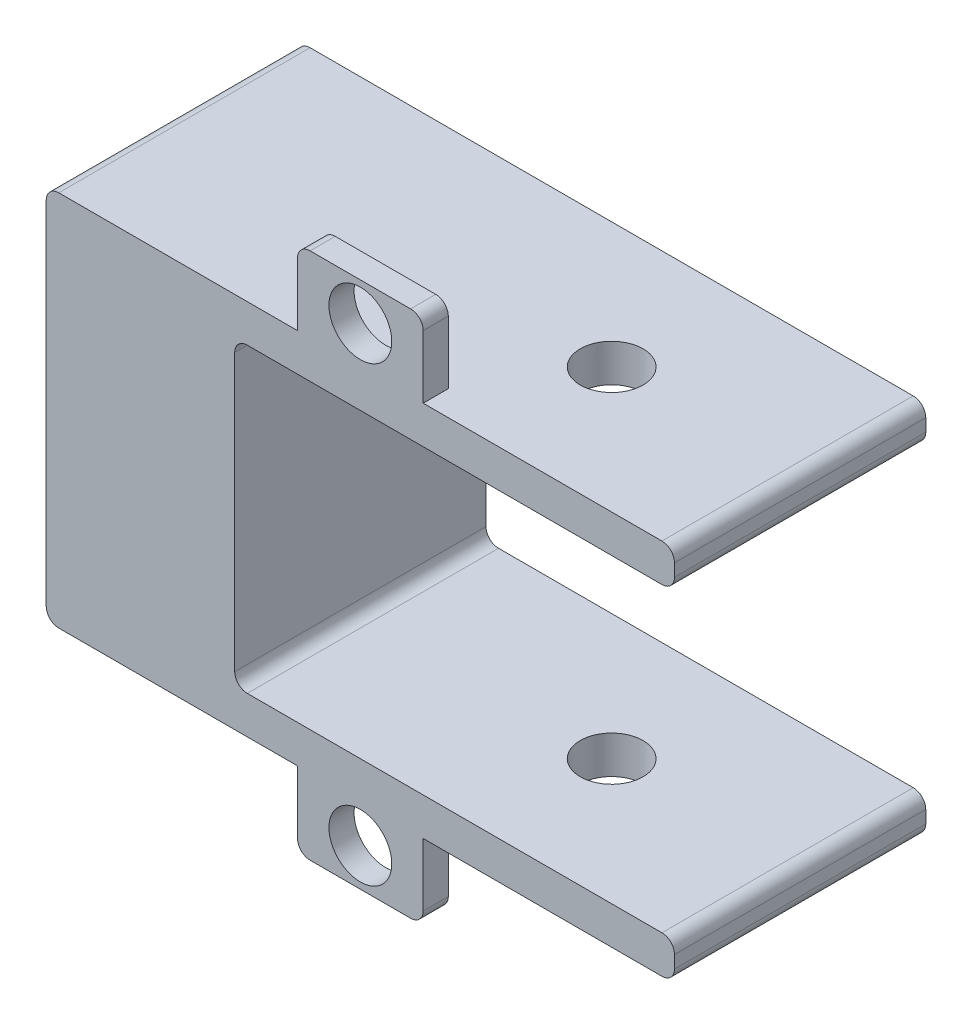
ISO-10303-21;
HEADER;
FILE_DESCRIPTION(('STEP AP214'),'2;1');
FILE_NAME('part.step','',(''),(''),'','','');
FILE_SCHEMA(('AUTOMOTIVE_DESIGN { 1 0 10303 214 1 1 1 1 }'));
ENDSEC;
DATA;
#1=APPLICATION_CONTEXT('core data for automotive mechanical design processes');
#2=APPLICATION_PROTOCOL_DEFINITION('international standard','automotive_design',2000,#1);
#3=PRODUCT_CONTEXT('',#1,'mechanical');
#4=PRODUCT('Part','Part','',(#3));
#5=PRODUCT_RELATED_PRODUCT_CATEGORY('part','',(#4));
#6=PRODUCT_DEFINITION_FORMATION('','',#4);
#7=PRODUCT_DEFINITION_CONTEXT('part definition',#1,'design');
#8=PRODUCT_DEFINITION('design','',#6,#7);
#9=PRODUCT_DEFINITION_SHAPE('','',#8);
#10=(LENGTH_UNIT() NAMED_UNIT(*) SI_UNIT(.MILLI.,.METRE.));
#11=(NAMED_UNIT(*) PLANE_ANGLE_UNIT() SI_UNIT($,.RADIAN.));
#12=(NAMED_UNIT(*) SI_UNIT($,.STERADIAN.) SOLID_ANGLE_UNIT());
#13=UNCERTAINTY_MEASURE_WITH_UNIT(LENGTH_MEASURE(1.E-05),#10,'distance_accuracy_value','');
#14=(GEOMETRIC_REPRESENTATION_CONTEXT(3) GLOBAL_UNCERTAINTY_ASSIGNED_CONTEXT((#13)) GLOBAL_UNIT_ASSIGNED_CONTEXT((#10,
#11,#12)) REPRESENTATION_CONTEXT('',''));
#15=CARTESIAN_POINT('',(0.,0.,0.));
#16=DIRECTION('',(0.,0.,1.));
#17=DIRECTION('',(1.,0.,0.));
#18=AXIS2_PLACEMENT_3D('',#15,#16,#17);
#19=CARTESIAN_POINT('',(0.,0.,25.4));
#20=DIRECTION('',(0.,1.,0.));
#21=DIRECTION('',(0.,0.,1.));
#22=AXIS2_PLACEMENT_3D('',#19,#20,#21);
#23=PLANE('',#22);
#24=CARTESIAN_POINT('',(44.45,0.,12.7));
#25=DIRECTION('',(0.,-1.,0.));
#26=DIRECTION('',(0.,0.,-1.));
#27=AXIS2_PLACEMENT_3D('',#24,#25,#26);
#28=CIRCLE('',#27,3.175);
#29=CARTESIAN_POINT('',(44.45,0.,9.525));
#30=VERTEX_POINT('',#29);
#31=EDGE_CURVE('E280',#30,#30,#28,.T.);
#32=ORIENTED_EDGE('',*,*,#31,.F.);
#33=EDGE_LOOP('',(#32));
#34=FACE_BOUND('',#33,.T.);
#35=DIRECTION('',(0.,0.,1.));
#36=VECTOR('',#35,1.);
#37=CARTESIAN_POINT('',(38.1,0.,22.86));
#38=LINE('',#37,#36);
#39=CARTESIAN_POINT('',(38.1,0.,22.86));
#40=VERTEX_POINT('',#39);
#41=CARTESIAN_POINT('',(38.1,0.,25.4));
#42=VERTEX_POINT('',#41);
#43=EDGE_CURVE('E240',#40,#42,#38,.T.);
#44=ORIENTED_EDGE('',*,*,#43,.F.);
#45=DIRECTION('',(-1.,0.,0.));
#46=VECTOR('',#45,1.);
#47=CARTESIAN_POINT('',(38.1,0.,22.86));
#48=LINE('',#47,#46);
#49=CARTESIAN_POINT('',(25.4,0.,22.86));
#50=VERTEX_POINT('',#49);
#51=EDGE_CURVE('E239',#40,#50,#48,.T.);
#52=ORIENTED_EDGE('',*,*,#51,.T.);
#53=DIRECTION('',(0.,0.,1.));
#54=VECTOR('',#53,1.);
#55=CARTESIAN_POINT('',(25.4,0.,22.86));
#56=LINE('',#55,#54);
#57=CARTESIAN_POINT('',(25.4,0.,25.4));
#58=VERTEX_POINT('',#57);
#59=EDGE_CURVE('E223',#50,#58,#56,.T.);
#60=ORIENTED_EDGE('',*,*,#59,.T.);
#61=DIRECTION('',(1.,0.,0.));
#62=VECTOR('',#61,1.);
#63=CARTESIAN_POINT('',(0.,0.,25.4));
#64=LINE('',#63,#62);
#65=CARTESIAN_POINT('',(1.27,0.,25.4));
#66=VERTEX_POINT('',#65);
#67=EDGE_CURVE('E236',#66,#58,#64,.T.);
#68=ORIENTED_EDGE('',*,*,#67,.F.);
#69=DIRECTION('',(0.,0.,-1.));
#70=VECTOR('',#69,1.);
#71=CARTESIAN_POINT('',(1.27,0.,25.4));
#72=LINE('',#71,#70);
#73=CARTESIAN_POINT('',(1.27,0.,0.));
#74=VERTEX_POINT('',#73);
#75=EDGE_CURVE('E317',#66,#74,#72,.T.);
#76=ORIENTED_EDGE('',*,*,#75,.T.);
#77=DIRECTION('',(1.,0.,0.));
#78=VECTOR('',#77,1.);
#79=CARTESIAN_POINT('',(0.,0.,0.));
#80=LINE('',#79,#78);
#81=CARTESIAN_POINT('',(62.23,0.,0.));
#82=VERTEX_POINT('',#81);
#83=EDGE_CURVE('E265',#74,#82,#80,.T.);
#84=ORIENTED_EDGE('',*,*,#83,.T.);
#85=DIRECTION('',(0.,0.,-1.));
#86=VECTOR('',#85,1.);
#87=CARTESIAN_POINT('',(62.23,0.,25.4));
#88=LINE('',#87,#86);
#89=CARTESIAN_POINT('',(62.23,0.,25.4));
#90=VERTEX_POINT('',#89);
#91=EDGE_CURVE('E314',#82,#90,#88,.F.);
#92=ORIENTED_EDGE('',*,*,#91,.T.);
#93=EDGE_CURVE('E247',#42,#90,#64,.T.);
#94=ORIENTED_EDGE('',*,*,#93,.F.);
#95=EDGE_LOOP('',(#44,#52,#60,#68,#76,#84,#92,#94));
#96=FACE_BOUND('',#95,.T.);
#97=ADVANCED_FACE('F33',(#34,#96),#23,.F.);
#98=CARTESIAN_POINT('',(0.,38.1,25.4));
#99=DIRECTION('',(0.,-1.,0.));
#100=DIRECTION('',(0.,0.,-1.));
#101=AXIS2_PLACEMENT_3D('',#98,#99,#100);
#102=PLANE('',#101);
#103=CARTESIAN_POINT('',(44.45,38.1,12.7));
#104=DIRECTION('',(0.,-1.,0.));
#105=DIRECTION('',(0.,0.,-1.));
#106=AXIS2_PLACEMENT_3D('',#103,#104,#105);
#107=CIRCLE('',#106,3.175);
#108=CARTESIAN_POINT('',(44.45,38.1,9.525));
#109=VERTEX_POINT('',#108);
#110=EDGE_CURVE('E411',#109,#109,#107,.T.);
#111=ORIENTED_EDGE('',*,*,#110,.T.);
#112=EDGE_LOOP('',(#111));
#113=FACE_BOUND('',#112,.T.);
#114=DIRECTION('',(0.,0.,1.));
#115=VECTOR('',#114,1.);
#116=CARTESIAN_POINT('',(25.4,38.1,25.4));
#117=LINE('',#116,#115);
#118=CARTESIAN_POINT('',(25.4,38.1,22.86));
#119=VERTEX_POINT('',#118);
#120=CARTESIAN_POINT('',(25.4,38.1,25.4));
#121=VERTEX_POINT('',#120);
#122=EDGE_CURVE('E399',#119,#121,#117,.T.);
#123=ORIENTED_EDGE('',*,*,#122,.F.);
#124=DIRECTION('',(-1.,0.,0.));
#125=VECTOR('',#124,1.);
#126=CARTESIAN_POINT('',(25.4,38.1,22.86));
#127=LINE('',#126,#125);
#128=CARTESIAN_POINT('',(38.1,38.1,22.86));
#129=VERTEX_POINT('',#128);
#130=EDGE_CURVE('E468',#129,#119,#127,.T.);
#131=ORIENTED_EDGE('',*,*,#130,.F.);
#132=DIRECTION('',(0.,0.,-1.));
#133=VECTOR('',#132,1.);
#134=CARTESIAN_POINT('',(38.1,38.1,25.4));
#135=LINE('',#134,#133);
#136=CARTESIAN_POINT('',(38.1,38.1,25.4));
#137=VERTEX_POINT('',#136);
#138=EDGE_CURVE('E459',#137,#129,#135,.T.);
#139=ORIENTED_EDGE('',*,*,#138,.F.);
#140=DIRECTION('',(-1.,0.,0.));
#141=VECTOR('',#140,1.);
#142=CARTESIAN_POINT('',(0.,38.1,25.4));
#143=LINE('',#142,#141);
#144=CARTESIAN_POINT('',(62.23,38.1,25.4));
#145=VERTEX_POINT('',#144);
#146=EDGE_CURVE('E258',#145,#137,#143,.T.);
#147=ORIENTED_EDGE('',*,*,#146,.F.);
#148=DIRECTION('',(0.,0.,-1.));
#149=VECTOR('',#148,1.);
#150=CARTESIAN_POINT('',(62.23,38.1,25.4));
#151=LINE('',#150,#149);
#152=CARTESIAN_POINT('',(62.23,38.1,0.));
#153=VERTEX_POINT('',#152);
#154=EDGE_CURVE('E297',#145,#153,#151,.T.);
#155=ORIENTED_EDGE('',*,*,#154,.T.);
#156=DIRECTION('',(-1.,0.,0.));
#157=VECTOR('',#156,1.);
#158=CARTESIAN_POINT('',(0.,38.1,0.));
#159=LINE('',#158,#157);
#160=CARTESIAN_POINT('',(1.27,38.1,0.));
#161=VERTEX_POINT('',#160);
#162=EDGE_CURVE('E273',#153,#161,#159,.T.);
#163=ORIENTED_EDGE('',*,*,#162,.T.);
#164=DIRECTION('',(0.,0.,-1.));
#165=VECTOR('',#164,1.);
#166=CARTESIAN_POINT('',(1.27,38.1,25.4));
#167=LINE('',#166,#165);
#168=CARTESIAN_POINT('',(1.27,38.1,25.4));
#169=VERTEX_POINT('',#168);
#170=EDGE_CURVE('E300',#161,#169,#167,.F.);
#171=ORIENTED_EDGE('',*,*,#170,.T.);
#172=EDGE_CURVE('E257',#121,#169,#143,.T.);
#173=ORIENTED_EDGE('',*,*,#172,.F.);
#174=EDGE_LOOP('',(#123,#131,#139,#147,#155,#163,#171,#173));
#175=FACE_BOUND('',#174,.T.);
#176=ADVANCED_FACE('F454',(#113,#175),#102,.F.);
#177=CARTESIAN_POINT('',(63.5,0.,25.4));
#178=DIRECTION('',(-1.,0.,0.));
#179=DIRECTION('',(0.,0.,1.));
#180=AXIS2_PLACEMENT_3D('',#177,#178,#179);
#181=PLANE('',#180);
#182=DIRECTION('',(0.,1.,0.));
#183=VECTOR('',#182,1.);
#184=CARTESIAN_POINT('',(63.5,0.,0.));
#185=LINE('',#184,#183);
#186=CARTESIAN_POINT('',(63.5,35.56,0.));
#187=VERTEX_POINT('',#186);
#188=CARTESIAN_POINT('',(63.5,36.83,0.));
#189=VERTEX_POINT('',#188);
#190=EDGE_CURVE('E269',#187,#189,#185,.T.);
#191=ORIENTED_EDGE('',*,*,#190,.T.);
#192=DIRECTION('',(0.,0.,-1.));
#193=VECTOR('',#192,1.);
#194=CARTESIAN_POINT('',(63.5,36.83,25.4));
#195=LINE('',#194,#193);
#196=CARTESIAN_POINT('',(63.5,36.83,25.4));
#197=VERTEX_POINT('',#196);
#198=EDGE_CURVE('E342',#189,#197,#195,.F.);
#199=ORIENTED_EDGE('',*,*,#198,.T.);
#200=DIRECTION('',(0.,1.,0.));
#201=VECTOR('',#200,1.);
#202=CARTESIAN_POINT('',(63.5,0.,25.4));
#203=LINE('',#202,#201);
#204=CARTESIAN_POINT('',(63.5,35.56,25.4));
#205=VERTEX_POINT('',#204);
#206=EDGE_CURVE('E246',#205,#197,#203,.T.);
#207=ORIENTED_EDGE('',*,*,#206,.F.);
#208=DIRECTION('',(0.,0.,-1.));
#209=VECTOR('',#208,1.);
#210=CARTESIAN_POINT('',(63.5,35.56,25.4));
#211=LINE('',#210,#209);
#212=EDGE_CURVE('E339',#205,#187,#211,.T.);
#213=ORIENTED_EDGE('',*,*,#212,.T.);
#214=EDGE_LOOP('',(#191,#199,#207,#213));
#215=FACE_BOUND('',#214,.T.);
#216=ADVANCED_FACE('F441',(#215),#181,.F.);
#217=CARTESIAN_POINT('',(0.,0.,25.4));
#218=DIRECTION('',(1.,0.,0.));
#219=DIRECTION('',(0.,0.,-1.));
#220=AXIS2_PLACEMENT_3D('',#217,#218,#219);
#221=PLANE('',#220);
#222=DIRECTION('',(0.,-1.,0.));
#223=VECTOR('',#222,1.);
#224=CARTESIAN_POINT('',(0.,0.,25.4));
#225=LINE('',#224,#223);
#226=CARTESIAN_POINT('',(0.,36.83,25.4));
#227=VERTEX_POINT('',#226);
#228=CARTESIAN_POINT('',(0.,1.27,25.4));
#229=VERTEX_POINT('',#228);
#230=EDGE_CURVE('E252',#227,#229,#225,.T.);
#231=ORIENTED_EDGE('',*,*,#230,.F.);
#232=DIRECTION('',(0.,0.,-1.));
#233=VECTOR('',#232,1.);
#234=CARTESIAN_POINT('',(0.,36.83,25.4));
#235=LINE('',#234,#233);
#236=CARTESIAN_POINT('',(0.,36.83,0.));
#237=VERTEX_POINT('',#236);
#238=EDGE_CURVE('E282',#227,#237,#235,.T.);
#239=ORIENTED_EDGE('',*,*,#238,.T.);
#240=DIRECTION('',(0.,-1.,0.));
#241=VECTOR('',#240,1.);
#242=CARTESIAN_POINT('',(0.,0.,0.));
#243=LINE('',#242,#241);
#244=CARTESIAN_POINT('',(0.,1.27,0.));
#245=VERTEX_POINT('',#244);
#246=EDGE_CURVE('E262',#237,#245,#243,.T.);
#247=ORIENTED_EDGE('',*,*,#246,.T.);
#248=DIRECTION('',(0.,0.,-1.));
#249=VECTOR('',#248,1.);
#250=CARTESIAN_POINT('',(0.,1.27,25.4));
#251=LINE('',#250,#249);
#252=EDGE_CURVE('E261',#245,#229,#251,.F.);
#253=ORIENTED_EDGE('',*,*,#252,.T.);
#254=EDGE_LOOP('',(#231,#239,#247,#253));
#255=FACE_BOUND('',#254,.T.);
#256=ADVANCED_FACE('F523',(#255),#221,.F.);
#257=CARTESIAN_POINT('',(63.5,1.27,0.));
#258=VERTEX_POINT('',#257);
#259=CARTESIAN_POINT('',(63.5,2.54,0.));
#260=VERTEX_POINT('',#259);
#261=EDGE_CURVE('E272',#258,#260,#185,.T.);
#262=ORIENTED_EDGE('',*,*,#261,.T.);
#263=DIRECTION('',(0.,0.,-1.));
#264=VECTOR('',#263,1.);
#265=CARTESIAN_POINT('',(63.5,2.54,25.4));
#266=LINE('',#265,#264);
#267=CARTESIAN_POINT('',(63.5,2.54,25.4));
#268=VERTEX_POINT('',#267);
#269=EDGE_CURVE('E337',#260,#268,#266,.F.);
#270=ORIENTED_EDGE('',*,*,#269,.T.);
#271=CARTESIAN_POINT('',(63.5,1.27,25.4));
#272=VERTEX_POINT('',#271);
#273=EDGE_CURVE('E250',#272,#268,#203,.T.);
#274=ORIENTED_EDGE('',*,*,#273,.F.);
#275=DIRECTION('',(0.,0.,-1.));
#276=VECTOR('',#275,1.);
#277=CARTESIAN_POINT('',(63.5,1.27,25.4));
#278=LINE('',#277,#276);
#279=EDGE_CURVE('E334',#272,#258,#278,.T.);
#280=ORIENTED_EDGE('',*,*,#279,.T.);
#281=EDGE_LOOP('',(#262,#270,#274,#280));
#282=FACE_BOUND('',#281,.T.);
#283=ADVANCED_FACE('F522',(#282),#181,.F.);
#284=CARTESIAN_POINT('',(0.,0.,25.4));
#285=DIRECTION('',(0.,0.,-1.));
#286=DIRECTION('',(-1.,0.,0.));
#287=AXIS2_PLACEMENT_3D('',#284,#285,#286);
#288=PLANE('',#287);
#289=CARTESIAN_POINT('',(31.75,41.91,25.4));
#290=DIRECTION('',(0.,0.,-1.));
#291=DIRECTION('',(-1.,0.,0.));
#292=AXIS2_PLACEMENT_3D('',#289,#290,#291);
#293=CIRCLE('',#292,3.175);
#294=CARTESIAN_POINT('',(28.575,41.91,25.4));
#295=VERTEX_POINT('',#294);
#296=EDGE_CURVE('E492',#295,#295,#293,.F.);
#297=ORIENTED_EDGE('',*,*,#296,.F.);
#298=EDGE_LOOP('',(#297));
#299=FACE_BOUND('',#298,.T.);
#300=CARTESIAN_POINT('',(31.75,-3.81,25.4));
#301=DIRECTION('',(0.,0.,-1.));
#302=DIRECTION('',(-1.,0.,0.));
#303=AXIS2_PLACEMENT_3D('',#300,#301,#302);
#304=CIRCLE('',#303,3.175);
#305=CARTESIAN_POINT('',(28.575,-3.81,25.4));
#306=VERTEX_POINT('',#305);
#307=EDGE_CURVE('E482',#306,#306,#304,.F.);
#308=ORIENTED_EDGE('',*,*,#307,.F.);
#309=EDGE_LOOP('',(#308));
#310=FACE_BOUND('',#309,.T.);
#311=DIRECTION('',(0.,1.,0.));
#312=VECTOR('',#311,1.);
#313=CARTESIAN_POINT('',(25.4,-7.62,25.4));
#314=LINE('',#313,#312);
#315=CARTESIAN_POINT('',(25.4,-6.35,25.4));
#316=VERTEX_POINT('',#315);
#317=EDGE_CURVE('E219',#316,#58,#314,.T.);
#318=ORIENTED_EDGE('',*,*,#317,.F.);
#319=CARTESIAN_POINT('',(26.67,-6.35,25.4));
#320=DIRECTION('',(0.,0.,-1.));
#321=DIRECTION('',(-1.,0.,0.));
#322=AXIS2_PLACEMENT_3D('',#319,#320,#321);
#323=CIRCLE('',#322,1.27);
#324=CARTESIAN_POINT('',(26.67,-7.62,25.4));
#325=VERTEX_POINT('',#324);
#326=EDGE_CURVE('E359',#316,#325,#323,.F.);
#327=ORIENTED_EDGE('',*,*,#326,.T.);
#328=DIRECTION('',(-1.,0.,0.));
#329=VECTOR('',#328,1.);
#330=CARTESIAN_POINT('',(38.1,-7.62,25.4));
#331=LINE('',#330,#329);
#332=CARTESIAN_POINT('',(36.83,-7.62,25.4));
#333=VERTEX_POINT('',#332);
#334=EDGE_CURVE('E478',#333,#325,#331,.T.);
#335=ORIENTED_EDGE('',*,*,#334,.F.);
#336=CARTESIAN_POINT('',(36.83,-6.35,25.4));
#337=DIRECTION('',(0.,0.,-1.));
#338=DIRECTION('',(-1.,0.,0.));
#339=AXIS2_PLACEMENT_3D('',#336,#337,#338);
#340=CIRCLE('',#339,1.27);
#341=CARTESIAN_POINT('',(38.1,-6.35,25.4));
#342=VERTEX_POINT('',#341);
#343=EDGE_CURVE('E357',#333,#342,#340,.F.);
#344=ORIENTED_EDGE('',*,*,#343,.T.);
#345=DIRECTION('',(0.,1.,0.));
#346=VECTOR('',#345,1.);
#347=CARTESIAN_POINT('',(38.1,-7.62,25.4));
#348=LINE('',#347,#346);
#349=EDGE_CURVE('E229',#342,#42,#348,.T.);
#350=ORIENTED_EDGE('',*,*,#349,.T.);
#351=ORIENTED_EDGE('',*,*,#93,.T.);
#352=CARTESIAN_POINT('',(62.23,1.27,25.4));
#353=DIRECTION('',(0.,0.,-1.));
#354=DIRECTION('',(-1.,0.,0.));
#355=AXIS2_PLACEMENT_3D('',#352,#353,#354);
#356=CIRCLE('',#355,1.27);
#357=EDGE_CURVE('E303',#90,#272,#356,.F.);
#358=ORIENTED_EDGE('',*,*,#357,.T.);
#359=ORIENTED_EDGE('',*,*,#273,.T.);
#360=CARTESIAN_POINT('',(62.23,2.54,25.4));
#361=DIRECTION('',(0.,0.,-1.));
#362=DIRECTION('',(-1.,0.,0.));
#363=AXIS2_PLACEMENT_3D('',#360,#361,#362);
#364=CIRCLE('',#363,1.27);
#365=CARTESIAN_POINT('',(62.23,3.81,25.4));
#366=VERTEX_POINT('',#365);
#367=EDGE_CURVE('E309',#268,#366,#364,.F.);
#368=ORIENTED_EDGE('',*,*,#367,.T.);
#369=DIRECTION('',(-1.,0.,0.));
#370=VECTOR('',#369,1.);
#371=CARTESIAN_POINT('',(0.,3.81,25.4));
#372=LINE('',#371,#370);
#373=CARTESIAN_POINT('',(20.32,3.81,25.4));
#374=VERTEX_POINT('',#373);
#375=EDGE_CURVE('E423',#366,#374,#372,.T.);
#376=ORIENTED_EDGE('',*,*,#375,.T.);
#377=CARTESIAN_POINT('',(20.32,5.08,25.4));
#378=DIRECTION('',(0.,0.,-1.));
#379=DIRECTION('',(-1.,0.,0.));
#380=AXIS2_PLACEMENT_3D('',#377,#378,#379);
#381=CIRCLE('',#380,1.27);
#382=CARTESIAN_POINT('',(19.05,5.08,25.4));
#383=VERTEX_POINT('',#382);
#384=EDGE_CURVE('E346',#374,#383,#381,.T.);
#385=ORIENTED_EDGE('',*,*,#384,.T.);
#386=DIRECTION('',(0.,1.,0.));
#387=VECTOR('',#386,1.);
#388=CARTESIAN_POINT('',(19.05,0.,25.4));
#389=LINE('',#388,#387);
#390=CARTESIAN_POINT('',(19.05,33.02,25.4));
#391=VERTEX_POINT('',#390);
#392=EDGE_CURVE('E426',#383,#391,#389,.T.);
#393=ORIENTED_EDGE('',*,*,#392,.T.);
#394=CARTESIAN_POINT('',(20.32,33.02,25.4));
#395=DIRECTION('',(0.,0.,-1.));
#396=DIRECTION('',(-1.,0.,0.));
#397=AXIS2_PLACEMENT_3D('',#394,#395,#396);
#398=CIRCLE('',#397,1.27);
#399=CARTESIAN_POINT('',(20.32,34.29,25.4));
#400=VERTEX_POINT('',#399);
#401=EDGE_CURVE('E350',#391,#400,#398,.T.);
#402=ORIENTED_EDGE('',*,*,#401,.T.);
#403=DIRECTION('',(1.,0.,0.));
#404=VECTOR('',#403,1.);
#405=CARTESIAN_POINT('',(0.,34.29,25.4));
#406=LINE('',#405,#404);
#407=CARTESIAN_POINT('',(62.23,34.29,25.4));
#408=VERTEX_POINT('',#407);
#409=EDGE_CURVE('E266',#400,#408,#406,.T.);
#410=ORIENTED_EDGE('',*,*,#409,.T.);
#411=CARTESIAN_POINT('',(62.23,35.56,25.4));
#412=DIRECTION('',(0.,0.,-1.));
#413=DIRECTION('',(-1.,0.,0.));
#414=AXIS2_PLACEMENT_3D('',#411,#412,#413);
#415=CIRCLE('',#414,1.27);
#416=EDGE_CURVE('E305',#408,#205,#415,.F.);
#417=ORIENTED_EDGE('',*,*,#416,.T.);
#418=ORIENTED_EDGE('',*,*,#206,.T.);
#419=CARTESIAN_POINT('',(62.23,36.83,25.4));
#420=DIRECTION('',(0.,0.,-1.));
#421=DIRECTION('',(-1.,0.,0.));
#422=AXIS2_PLACEMENT_3D('',#419,#420,#421);
#423=CIRCLE('',#422,1.27);
#424=EDGE_CURVE('E307',#197,#145,#423,.F.);
#425=ORIENTED_EDGE('',*,*,#424,.T.);
#426=ORIENTED_EDGE('',*,*,#146,.T.);
#427=DIRECTION('',(0.,-1.,0.));
#428=VECTOR('',#427,1.);
#429=CARTESIAN_POINT('',(38.1,45.72,25.4));
#430=LINE('',#429,#428);
#431=CARTESIAN_POINT('',(38.1,44.45,25.4));
#432=VERTEX_POINT('',#431);
#433=EDGE_CURVE('E401',#432,#137,#430,.T.);
#434=ORIENTED_EDGE('',*,*,#433,.F.);
#435=CARTESIAN_POINT('',(36.83,44.45,25.4));
#436=DIRECTION('',(0.,0.,-1.));
#437=DIRECTION('',(-1.,0.,0.));
#438=AXIS2_PLACEMENT_3D('',#435,#436,#437);
#439=CIRCLE('',#438,1.27);
#440=CARTESIAN_POINT('',(36.83,45.72,25.4));
#441=VERTEX_POINT('',#440);
#442=EDGE_CURVE('E353',#432,#441,#439,.F.);
#443=ORIENTED_EDGE('',*,*,#442,.T.);
#444=DIRECTION('',(1.,0.,0.));
#445=VECTOR('',#444,1.);
#446=CARTESIAN_POINT('',(25.4,45.72,25.4));
#447=LINE('',#446,#445);
#448=CARTESIAN_POINT('',(26.67,45.72,25.4));
#449=VERTEX_POINT('',#448);
#450=EDGE_CURVE('E392',#449,#441,#447,.T.);
#451=ORIENTED_EDGE('',*,*,#450,.F.);
#452=CARTESIAN_POINT('',(26.67,44.45,25.4));
#453=DIRECTION('',(0.,0.,-1.));
#454=DIRECTION('',(-1.,0.,0.));
#455=AXIS2_PLACEMENT_3D('',#452,#453,#454);
#456=CIRCLE('',#455,1.27);
#457=CARTESIAN_POINT('',(25.4,44.45,25.4));
#458=VERTEX_POINT('',#457);
#459=EDGE_CURVE('E355',#449,#458,#456,.F.);
#460=ORIENTED_EDGE('',*,*,#459,.T.);
#461=DIRECTION('',(0.,-1.,0.));
#462=VECTOR('',#461,1.);
#463=CARTESIAN_POINT('',(25.4,45.72,25.4));
#464=LINE('',#463,#462);
#465=EDGE_CURVE('E395',#458,#121,#464,.T.);
#466=ORIENTED_EDGE('',*,*,#465,.T.);
#467=ORIENTED_EDGE('',*,*,#172,.T.);
#468=CARTESIAN_POINT('',(1.27,36.83,25.4));
#469=DIRECTION('',(0.,0.,-1.));
#470=DIRECTION('',(-1.,0.,0.));
#471=AXIS2_PLACEMENT_3D('',#468,#469,#470);
#472=CIRCLE('',#471,1.27);
#473=EDGE_CURVE('E312',#169,#227,#472,.F.);
#474=ORIENTED_EDGE('',*,*,#473,.T.);
#475=ORIENTED_EDGE('',*,*,#230,.T.);
#476=CARTESIAN_POINT('',(1.27,1.27,25.4));
#477=DIRECTION('',(0.,0.,-1.));
#478=DIRECTION('',(-1.,0.,0.));
#479=AXIS2_PLACEMENT_3D('',#476,#477,#478);
#480=CIRCLE('',#479,1.27);
#481=EDGE_CURVE('E245',#229,#66,#480,.F.);
#482=ORIENTED_EDGE('',*,*,#481,.T.);
#483=ORIENTED_EDGE('',*,*,#67,.T.);
#484=EDGE_LOOP('',(#318,#327,#335,#344,#350,#351,#358,#359,#368,#376,#385,#393,#402,#410,#417,
#418,#425,#426,#434,#443,#451,#460,#466,#467,#474,#475,#482,#483));
#485=FACE_BOUND('',#484,.T.);
#486=ADVANCED_FACE('F242',(#299,#310,#485),#288,.F.);
#487=CARTESIAN_POINT('',(0.,0.,0.));
#488=DIRECTION('',(0.,0.,-1.));
#489=DIRECTION('',(-1.,0.,0.));
#490=AXIS2_PLACEMENT_3D('',#487,#488,#489);
#491=PLANE('',#490);
#492=ORIENTED_EDGE('',*,*,#246,.F.);
#493=CARTESIAN_POINT('',(1.27,36.83,0.));
#494=DIRECTION('',(0.,0.,-1.));
#495=DIRECTION('',(-1.,0.,0.));
#496=AXIS2_PLACEMENT_3D('',#493,#494,#495);
#497=CIRCLE('',#496,1.27);
#498=EDGE_CURVE('E295',#237,#161,#497,.T.);
#499=ORIENTED_EDGE('',*,*,#498,.T.);
#500=ORIENTED_EDGE('',*,*,#162,.F.);
#501=CARTESIAN_POINT('',(62.23,36.83,0.));
#502=DIRECTION('',(0.,0.,-1.));
#503=DIRECTION('',(-1.,0.,0.));
#504=AXIS2_PLACEMENT_3D('',#501,#502,#503);
#505=CIRCLE('',#504,1.27);
#506=EDGE_CURVE('E289',#153,#189,#505,.T.);
#507=ORIENTED_EDGE('',*,*,#506,.T.);
#508=ORIENTED_EDGE('',*,*,#190,.F.);
#509=CARTESIAN_POINT('',(62.23,35.56,0.));
#510=DIRECTION('',(0.,0.,-1.));
#511=DIRECTION('',(-1.,0.,0.));
#512=AXIS2_PLACEMENT_3D('',#509,#510,#511);
#513=CIRCLE('',#512,1.27);
#514=CARTESIAN_POINT('',(62.23,34.29,0.));
#515=VERTEX_POINT('',#514);
#516=EDGE_CURVE('E287',#187,#515,#513,.T.);
#517=ORIENTED_EDGE('',*,*,#516,.T.);
#518=DIRECTION('',(1.,0.,0.));
#519=VECTOR('',#518,1.);
#520=CARTESIAN_POINT('',(63.5,34.29,0.));
#521=LINE('',#520,#519);
#522=CARTESIAN_POINT('',(20.32,34.29,0.));
#523=VERTEX_POINT('',#522);
#524=EDGE_CURVE('E420',#523,#515,#521,.T.);
#525=ORIENTED_EDGE('',*,*,#524,.F.);
#526=CARTESIAN_POINT('',(20.32,33.02,0.));
#527=DIRECTION('',(0.,0.,-1.));
#528=DIRECTION('',(-1.,0.,0.));
#529=AXIS2_PLACEMENT_3D('',#526,#527,#528);
#530=CIRCLE('',#529,1.27);
#531=CARTESIAN_POINT('',(19.05,33.02,0.));
#532=VERTEX_POINT('',#531);
#533=EDGE_CURVE('E348',#523,#532,#530,.F.);
#534=ORIENTED_EDGE('',*,*,#533,.T.);
#535=DIRECTION('',(0.,1.,0.));
#536=VECTOR('',#535,1.);
#537=CARTESIAN_POINT('',(19.05,34.29,0.));
#538=LINE('',#537,#536);
#539=CARTESIAN_POINT('',(19.05,5.08,0.));
#540=VERTEX_POINT('',#539);
#541=EDGE_CURVE('E417',#540,#532,#538,.T.);
#542=ORIENTED_EDGE('',*,*,#541,.F.);
#543=CARTESIAN_POINT('',(20.32,5.08,0.));
#544=DIRECTION('',(0.,0.,-1.));
#545=DIRECTION('',(-1.,0.,0.));
#546=AXIS2_PLACEMENT_3D('',#543,#544,#545);
#547=CIRCLE('',#546,1.27);
#548=CARTESIAN_POINT('',(20.32,3.81,0.));
#549=VERTEX_POINT('',#548);
#550=EDGE_CURVE('E344',#540,#549,#547,.F.);
#551=ORIENTED_EDGE('',*,*,#550,.T.);
#552=DIRECTION('',(-1.,0.,0.));
#553=VECTOR('',#552,1.);
#554=CARTESIAN_POINT('',(63.5,3.81,0.));
#555=LINE('',#554,#553);
#556=CARTESIAN_POINT('',(62.23,3.81,0.));
#557=VERTEX_POINT('',#556);
#558=EDGE_CURVE('E414',#557,#549,#555,.T.);
#559=ORIENTED_EDGE('',*,*,#558,.F.);
#560=CARTESIAN_POINT('',(62.23,2.54,0.));
#561=DIRECTION('',(0.,0.,-1.));
#562=DIRECTION('',(-1.,0.,0.));
#563=AXIS2_PLACEMENT_3D('',#560,#561,#562);
#564=CIRCLE('',#563,1.27);
#565=EDGE_CURVE('E291',#557,#260,#564,.T.);
#566=ORIENTED_EDGE('',*,*,#565,.T.);
#567=ORIENTED_EDGE('',*,*,#261,.F.);
#568=CARTESIAN_POINT('',(62.23,1.27,0.));
#569=DIRECTION('',(0.,0.,-1.));
#570=DIRECTION('',(-1.,0.,0.));
#571=AXIS2_PLACEMENT_3D('',#568,#569,#570);
#572=CIRCLE('',#571,1.27);
#573=EDGE_CURVE('E285',#258,#82,#572,.T.);
#574=ORIENTED_EDGE('',*,*,#573,.T.);
#575=ORIENTED_EDGE('',*,*,#83,.F.);
#576=CARTESIAN_POINT('',(1.27,1.27,0.));
#577=DIRECTION('',(0.,0.,-1.));
#578=DIRECTION('',(-1.,0.,0.));
#579=AXIS2_PLACEMENT_3D('',#576,#577,#578);
#580=CIRCLE('',#579,1.27);
#581=EDGE_CURVE('E293',#74,#245,#580,.T.);
#582=ORIENTED_EDGE('',*,*,#581,.T.);
#583=EDGE_LOOP('',(#492,#499,#500,#507,#508,#517,#525,#534,#542,#551,#559,#566,#567,#574,#575,#582));
#584=FACE_BOUND('',#583,.T.);
#585=ADVANCED_FACE('F445',(#584),#491,.T.);
#586=CARTESIAN_POINT('',(63.5,34.29,38.1));
#587=DIRECTION('',(0.,1.,0.));
#588=DIRECTION('',(0.,0.,1.));
#589=AXIS2_PLACEMENT_3D('',#586,#587,#588);
#590=PLANE('',#589);
#591=CARTESIAN_POINT('',(44.45,34.29,12.7));
#592=DIRECTION('',(0.,1.,0.));
#593=DIRECTION('',(0.,0.,1.));
#594=AXIS2_PLACEMENT_3D('',#591,#592,#593);
#595=CIRCLE('',#594,3.175);
#596=CARTESIAN_POINT('',(44.45,34.29,15.875));
#597=VERTEX_POINT('',#596);
#598=EDGE_CURVE('E279',#597,#597,#595,.T.);
#599=ORIENTED_EDGE('',*,*,#598,.T.);
#600=EDGE_LOOP('',(#599));
#601=FACE_BOUND('',#600,.T.);
#602=ORIENTED_EDGE('',*,*,#409,.F.);
#603=DIRECTION('',(0.,0.,-1.));
#604=VECTOR('',#603,1.);
#605=CARTESIAN_POINT('',(20.32,34.29,0.));
#606=LINE('',#605,#604);
#607=EDGE_CURVE('E331',#400,#523,#606,.T.);
#608=ORIENTED_EDGE('',*,*,#607,.T.);
#609=ORIENTED_EDGE('',*,*,#524,.T.);
#610=DIRECTION('',(0.,0.,-1.));
#611=VECTOR('',#610,1.);
#612=CARTESIAN_POINT('',(62.23,34.29,38.1));
#613=LINE('',#612,#611);
#614=EDGE_CURVE('E329',#515,#408,#613,.F.);
#615=ORIENTED_EDGE('',*,*,#614,.T.);
#616=EDGE_LOOP('',(#602,#608,#609,#615));
#617=FACE_BOUND('',#616,.T.);
#618=ADVANCED_FACE('F760',(#601,#617),#590,.F.);
#619=CARTESIAN_POINT('',(19.05,34.29,38.1));
#620=DIRECTION('',(-1.,0.,0.));
#621=DIRECTION('',(0.,-1.,0.));
#622=AXIS2_PLACEMENT_3D('',#619,#620,#621);
#623=PLANE('',#622);
#624=ORIENTED_EDGE('',*,*,#392,.F.);
#625=DIRECTION('',(0.,0.,-1.));
#626=VECTOR('',#625,1.);
#627=CARTESIAN_POINT('',(19.05,5.08,0.));
#628=LINE('',#627,#626);
#629=EDGE_CURVE('E321',#383,#540,#628,.T.);
#630=ORIENTED_EDGE('',*,*,#629,.T.);
#631=ORIENTED_EDGE('',*,*,#541,.T.);
#632=DIRECTION('',(0.,0.,-1.));
#633=VECTOR('',#632,1.);
#634=CARTESIAN_POINT('',(19.05,33.02,25.4));
#635=LINE('',#634,#633);
#636=EDGE_CURVE('E319',#532,#391,#635,.F.);
#637=ORIENTED_EDGE('',*,*,#636,.T.);
#638=EDGE_LOOP('',(#624,#630,#631,#637));
#639=FACE_BOUND('',#638,.T.);
#640=ADVANCED_FACE('F748',(#639),#623,.F.);
#641=CARTESIAN_POINT('',(63.5,3.81,38.1));
#642=DIRECTION('',(0.,-1.,0.));
#643=DIRECTION('',(1.,0.,0.));
#644=AXIS2_PLACEMENT_3D('',#641,#642,#643);
#645=PLANE('',#644);
#646=CARTESIAN_POINT('',(44.45,3.81000000000001,12.7));
#647=DIRECTION('',(0.,-1.,0.));
#648=DIRECTION('',(1.,0.,0.));
#649=AXIS2_PLACEMENT_3D('',#646,#647,#648);
#650=CIRCLE('',#649,3.175);
#651=CARTESIAN_POINT('',(47.625,3.81000000000001,12.7));
#652=VERTEX_POINT('',#651);
#653=EDGE_CURVE('E276',#652,#652,#650,.T.);
#654=ORIENTED_EDGE('',*,*,#653,.T.);
#655=EDGE_LOOP('',(#654));
#656=FACE_BOUND('',#655,.T.);
#657=ORIENTED_EDGE('',*,*,#558,.T.);
#658=DIRECTION('',(0.,0.,-1.));
#659=VECTOR('',#658,1.);
#660=CARTESIAN_POINT('',(20.32,3.81,25.4));
#661=LINE('',#660,#659);
#662=EDGE_CURVE('E327',#549,#374,#661,.F.);
#663=ORIENTED_EDGE('',*,*,#662,.T.);
#664=ORIENTED_EDGE('',*,*,#375,.F.);
#665=DIRECTION('',(0.,0.,-1.));
#666=VECTOR('',#665,1.);
#667=CARTESIAN_POINT('',(62.23,3.81,38.1));
#668=LINE('',#667,#666);
#669=EDGE_CURVE('E324',#366,#557,#668,.T.);
#670=ORIENTED_EDGE('',*,*,#669,.T.);
#671=EDGE_LOOP('',(#657,#663,#664,#670));
#672=FACE_BOUND('',#671,.T.);
#673=ADVANCED_FACE('F742',(#656,#672),#645,.F.);
#674=CARTESIAN_POINT('',(44.45,76.2,12.7));
#675=DIRECTION('',(0.,-1.,0.));
#676=DIRECTION('',(0.,0.,-1.));
#677=AXIS2_PLACEMENT_3D('',#674,#675,#676);
#678=CYLINDRICAL_SURFACE('',#677,3.175);
#679=ORIENTED_EDGE('',*,*,#31,.T.);
#680=EDGE_LOOP('',(#679));
#681=FACE_BOUND('',#680,.T.);
#682=ORIENTED_EDGE('',*,*,#653,.F.);
#683=EDGE_LOOP('',(#682));
#684=FACE_BOUND('',#683,.T.);
#685=ADVANCED_FACE('F747',(#681,#684),#678,.F.);
#686=ORIENTED_EDGE('',*,*,#598,.F.);
#687=EDGE_LOOP('',(#686));
#688=FACE_BOUND('',#687,.T.);
#689=ORIENTED_EDGE('',*,*,#110,.F.);
#690=EDGE_LOOP('',(#689));
#691=FACE_BOUND('',#690,.T.);
#692=ADVANCED_FACE('F531',(#688,#691),#678,.F.);
#693=CARTESIAN_POINT('',(1.27,36.83,25.4));
#694=DIRECTION('',(0.,0.,-1.));
#695=DIRECTION('',(-1.,0.,0.));
#696=AXIS2_PLACEMENT_3D('',#693,#694,#695);
#697=CYLINDRICAL_SURFACE('',#696,1.27);
#698=ORIENTED_EDGE('',*,*,#473,.F.);
#699=ORIENTED_EDGE('',*,*,#170,.F.);
#700=ORIENTED_EDGE('',*,*,#498,.F.);
#701=ORIENTED_EDGE('',*,*,#238,.F.);
#702=EDGE_LOOP('',(#698,#699,#700,#701));
#703=FACE_BOUND('',#702,.T.);
#704=ADVANCED_FACE('F527',(#703),#697,.T.);
#705=CARTESIAN_POINT('',(1.27,1.27,25.4));
#706=DIRECTION('',(0.,0.,-1.));
#707=DIRECTION('',(-1.,0.,0.));
#708=AXIS2_PLACEMENT_3D('',#705,#706,#707);
#709=CYLINDRICAL_SURFACE('',#708,1.27);
#710=ORIENTED_EDGE('',*,*,#481,.F.);
#711=ORIENTED_EDGE('',*,*,#252,.F.);
#712=ORIENTED_EDGE('',*,*,#581,.F.);
#713=ORIENTED_EDGE('',*,*,#75,.F.);
#714=EDGE_LOOP('',(#710,#711,#712,#713));
#715=FACE_BOUND('',#714,.T.);
#716=ADVANCED_FACE('F530',(#715),#709,.T.);
#717=CARTESIAN_POINT('',(20.32,5.08,38.1));
#718=DIRECTION('',(0.,0.,1.));
#719=DIRECTION('',(1.,0.,0.));
#720=AXIS2_PLACEMENT_3D('',#717,#718,#719);
#721=CYLINDRICAL_SURFACE('',#720,1.27);
#722=ORIENTED_EDGE('',*,*,#384,.F.);
#723=ORIENTED_EDGE('',*,*,#662,.F.);
#724=ORIENTED_EDGE('',*,*,#550,.F.);
#725=ORIENTED_EDGE('',*,*,#629,.F.);
#726=EDGE_LOOP('',(#722,#723,#724,#725));
#727=FACE_BOUND('',#726,.T.);
#728=ADVANCED_FACE('F535',(#727),#721,.F.);
#729=CARTESIAN_POINT('',(20.32,33.02,38.1));
#730=DIRECTION('',(0.,0.,1.));
#731=DIRECTION('',(1.,0.,0.));
#732=AXIS2_PLACEMENT_3D('',#729,#730,#731);
#733=CYLINDRICAL_SURFACE('',#732,1.27);
#734=ORIENTED_EDGE('',*,*,#401,.F.);
#735=ORIENTED_EDGE('',*,*,#636,.F.);
#736=ORIENTED_EDGE('',*,*,#533,.F.);
#737=ORIENTED_EDGE('',*,*,#607,.F.);
#738=EDGE_LOOP('',(#734,#735,#736,#737));
#739=FACE_BOUND('',#738,.T.);
#740=ADVANCED_FACE('F539',(#739),#733,.F.);
#741=CARTESIAN_POINT('',(62.23,2.54,38.1));
#742=DIRECTION('',(0.,0.,-1.));
#743=DIRECTION('',(-1.,0.,0.));
#744=AXIS2_PLACEMENT_3D('',#741,#742,#743);
#745=CYLINDRICAL_SURFACE('',#744,1.27);
#746=ORIENTED_EDGE('',*,*,#367,.F.);
#747=ORIENTED_EDGE('',*,*,#269,.F.);
#748=ORIENTED_EDGE('',*,*,#565,.F.);
#749=ORIENTED_EDGE('',*,*,#669,.F.);
#750=EDGE_LOOP('',(#746,#747,#748,#749));
#751=FACE_BOUND('',#750,.T.);
#752=ADVANCED_FACE('F543',(#751),#745,.T.);
#753=CARTESIAN_POINT('',(62.23,36.83,25.4));
#754=DIRECTION('',(0.,0.,-1.));
#755=DIRECTION('',(-1.,0.,0.));
#756=AXIS2_PLACEMENT_3D('',#753,#754,#755);
#757=CYLINDRICAL_SURFACE('',#756,1.27);
#758=ORIENTED_EDGE('',*,*,#424,.F.);
#759=ORIENTED_EDGE('',*,*,#198,.F.);
#760=ORIENTED_EDGE('',*,*,#506,.F.);
#761=ORIENTED_EDGE('',*,*,#154,.F.);
#762=EDGE_LOOP('',(#758,#759,#760,#761));
#763=FACE_BOUND('',#762,.T.);
#764=ADVANCED_FACE('F451',(#763),#757,.T.);
#765=CARTESIAN_POINT('',(62.23,35.56,25.4));
#766=DIRECTION('',(0.,0.,-1.));
#767=DIRECTION('',(-1.,0.,0.));
#768=AXIS2_PLACEMENT_3D('',#765,#766,#767);
#769=CYLINDRICAL_SURFACE('',#768,1.27);
#770=ORIENTED_EDGE('',*,*,#416,.F.);
#771=ORIENTED_EDGE('',*,*,#614,.F.);
#772=ORIENTED_EDGE('',*,*,#516,.F.);
#773=ORIENTED_EDGE('',*,*,#212,.F.);
#774=EDGE_LOOP('',(#770,#771,#772,#773));
#775=FACE_BOUND('',#774,.T.);
#776=ADVANCED_FACE('F438',(#775),#769,.T.);
#777=CARTESIAN_POINT('',(62.23,1.27,25.4));
#778=DIRECTION('',(0.,0.,-1.));
#779=DIRECTION('',(-1.,0.,0.));
#780=AXIS2_PLACEMENT_3D('',#777,#778,#779);
#781=CYLINDRICAL_SURFACE('',#780,1.27);
#782=ORIENTED_EDGE('',*,*,#357,.F.);
#783=ORIENTED_EDGE('',*,*,#91,.F.);
#784=ORIENTED_EDGE('',*,*,#573,.F.);
#785=ORIENTED_EDGE('',*,*,#279,.F.);
#786=EDGE_LOOP('',(#782,#783,#784,#785));
#787=FACE_BOUND('',#786,.T.);
#788=ADVANCED_FACE('F552',(#787),#781,.T.);
#789=CARTESIAN_POINT('',(25.4,45.72,25.4));
#790=DIRECTION('',(1.,0.,0.));
#791=DIRECTION('',(0.,0.,-1.));
#792=AXIS2_PLACEMENT_3D('',#789,#790,#791);
#793=PLANE('',#792);
#794=ORIENTED_EDGE('',*,*,#465,.F.);
#795=DIRECTION('',(0.,0.,1.));
#796=VECTOR('',#795,1.);
#797=CARTESIAN_POINT('',(25.4,44.45,25.4));
#798=LINE('',#797,#796);
#799=CARTESIAN_POINT('',(25.4,44.45,22.86));
#800=VERTEX_POINT('',#799);
#801=EDGE_CURVE('E56',#458,#800,#798,.F.);
#802=ORIENTED_EDGE('',*,*,#801,.T.);
#803=DIRECTION('',(0.,-1.,0.));
#804=VECTOR('',#803,1.);
#805=CARTESIAN_POINT('',(25.4,45.72,22.86));
#806=LINE('',#805,#804);
#807=EDGE_CURVE('E384',#800,#119,#806,.T.);
#808=ORIENTED_EDGE('',*,*,#807,.T.);
#809=ORIENTED_EDGE('',*,*,#122,.T.);
#810=EDGE_LOOP('',(#794,#802,#808,#809));
#811=FACE_BOUND('',#810,.T.);
#812=ADVANCED_FACE('F397',(#811),#793,.F.);
#813=CARTESIAN_POINT('',(38.1,45.72,25.4));
#814=DIRECTION('',(-1.,0.,0.));
#815=DIRECTION('',(0.,0.,1.));
#816=AXIS2_PLACEMENT_3D('',#813,#814,#815);
#817=PLANE('',#816);
#818=DIRECTION('',(0.,-1.,0.));
#819=VECTOR('',#818,1.);
#820=CARTESIAN_POINT('',(38.1,45.72,22.86));
#821=LINE('',#820,#819);
#822=CARTESIAN_POINT('',(38.1,44.45,22.86));
#823=VERTEX_POINT('',#822);
#824=EDGE_CURVE('E405',#823,#129,#821,.T.);
#825=ORIENTED_EDGE('',*,*,#824,.F.);
#826=DIRECTION('',(0.,0.,-1.));
#827=VECTOR('',#826,1.);
#828=CARTESIAN_POINT('',(38.1,44.45,25.4));
#829=LINE('',#828,#827);
#830=EDGE_CURVE('E11',#823,#432,#829,.F.);
#831=ORIENTED_EDGE('',*,*,#830,.T.);
#832=ORIENTED_EDGE('',*,*,#433,.T.);
#833=ORIENTED_EDGE('',*,*,#138,.T.);
#834=EDGE_LOOP('',(#825,#831,#832,#833));
#835=FACE_BOUND('',#834,.T.);
#836=ADVANCED_FACE('F465',(#835),#817,.F.);
#837=CARTESIAN_POINT('',(25.4,45.72,22.86));
#838=DIRECTION('',(0.,0.,1.));
#839=DIRECTION('',(1.,0.,0.));
#840=AXIS2_PLACEMENT_3D('',#837,#838,#839);
#841=PLANE('',#840);
#842=CARTESIAN_POINT('',(31.75,41.91,22.86));
#843=DIRECTION('',(0.,0.,-1.));
#844=DIRECTION('',(-1.,0.,0.));
#845=AXIS2_PLACEMENT_3D('',#842,#843,#844);
#846=CIRCLE('',#845,3.175);
#847=CARTESIAN_POINT('',(28.575,41.91,22.86));
#848=VERTEX_POINT('',#847);
#849=EDGE_CURVE('E495',#848,#848,#846,.T.);
#850=ORIENTED_EDGE('',*,*,#849,.F.);
#851=EDGE_LOOP('',(#850));
#852=FACE_BOUND('',#851,.T.);
#853=ORIENTED_EDGE('',*,*,#807,.F.);
#854=CARTESIAN_POINT('',(26.67,44.45,22.86));
#855=DIRECTION('',(0.,0.,1.));
#856=DIRECTION('',(1.,0.,0.));
#857=AXIS2_PLACEMENT_3D('',#854,#855,#856);
#858=CIRCLE('',#857,1.27);
#859=CARTESIAN_POINT('',(26.67,45.72,22.86));
#860=VERTEX_POINT('',#859);
#861=EDGE_CURVE('E41',#800,#860,#858,.F.);
#862=ORIENTED_EDGE('',*,*,#861,.T.);
#863=DIRECTION('',(-1.,0.,0.));
#864=VECTOR('',#863,1.);
#865=CARTESIAN_POINT('',(25.4,45.72,22.86));
#866=LINE('',#865,#864);
#867=CARTESIAN_POINT('',(36.83,45.72,22.86));
#868=VERTEX_POINT('',#867);
#869=EDGE_CURVE('E382',#868,#860,#866,.T.);
#870=ORIENTED_EDGE('',*,*,#869,.F.);
#871=CARTESIAN_POINT('',(36.83,44.45,22.86));
#872=DIRECTION('',(0.,0.,1.));
#873=DIRECTION('',(1.,0.,0.));
#874=AXIS2_PLACEMENT_3D('',#871,#872,#873);
#875=CIRCLE('',#874,1.27);
#876=EDGE_CURVE('E48',#868,#823,#875,.F.);
#877=ORIENTED_EDGE('',*,*,#876,.T.);
#878=ORIENTED_EDGE('',*,*,#824,.T.);
#879=ORIENTED_EDGE('',*,*,#130,.T.);
#880=EDGE_LOOP('',(#853,#862,#870,#877,#878,#879));
#881=FACE_BOUND('',#880,.T.);
#882=ADVANCED_FACE('F381',(#852,#881),#841,.F.);
#883=CARTESIAN_POINT('',(0.,45.72,0.));
#884=DIRECTION('',(0.,-1.,0.));
#885=DIRECTION('',(0.,0.,-1.));
#886=AXIS2_PLACEMENT_3D('',#883,#884,#885);
#887=PLANE('',#886);
#888=ORIENTED_EDGE('',*,*,#869,.T.);
#889=DIRECTION('',(0.,0.,1.));
#890=VECTOR('',#889,1.);
#891=CARTESIAN_POINT('',(26.67,45.72,0.));
#892=LINE('',#891,#890);
#893=EDGE_CURVE('E375',#860,#449,#892,.T.);
#894=ORIENTED_EDGE('',*,*,#893,.T.);
#895=ORIENTED_EDGE('',*,*,#450,.T.);
#896=DIRECTION('',(0.,0.,-1.));
#897=VECTOR('',#896,1.);
#898=CARTESIAN_POINT('',(36.83,45.72,0.));
#899=LINE('',#898,#897);
#900=EDGE_CURVE('E372',#441,#868,#899,.T.);
#901=ORIENTED_EDGE('',*,*,#900,.T.);
#902=EDGE_LOOP('',(#888,#894,#895,#901));
#903=FACE_BOUND('',#902,.T.);
#904=ADVANCED_FACE('F388',(#903),#887,.F.);
#905=CARTESIAN_POINT('',(38.1,-7.62,22.86));
#906=DIRECTION('',(-1.,0.,0.));
#907=DIRECTION('',(0.,0.,1.));
#908=AXIS2_PLACEMENT_3D('',#905,#906,#907);
#909=PLANE('',#908);
#910=ORIENTED_EDGE('',*,*,#349,.F.);
#911=DIRECTION('',(0.,0.,1.));
#912=VECTOR('',#911,1.);
#913=CARTESIAN_POINT('',(38.1,-6.35,22.86));
#914=LINE('',#913,#912);
#915=CARTESIAN_POINT('',(38.1,-6.35,22.86));
#916=VERTEX_POINT('',#915);
#917=EDGE_CURVE('E370',#342,#916,#914,.F.);
#918=ORIENTED_EDGE('',*,*,#917,.T.);
#919=DIRECTION('',(0.,1.,0.));
#920=VECTOR('',#919,1.);
#921=CARTESIAN_POINT('',(38.1,-7.62,22.86));
#922=LINE('',#921,#920);
#923=EDGE_CURVE('E475',#916,#40,#922,.T.);
#924=ORIENTED_EDGE('',*,*,#923,.T.);
#925=ORIENTED_EDGE('',*,*,#43,.T.);
#926=EDGE_LOOP('',(#910,#918,#924,#925));
#927=FACE_BOUND('',#926,.T.);
#928=ADVANCED_FACE('F508',(#927),#909,.F.);
#929=CARTESIAN_POINT('',(25.4,-7.62,22.86));
#930=DIRECTION('',(-1.,0.,0.));
#931=DIRECTION('',(0.,0.,1.));
#932=AXIS2_PLACEMENT_3D('',#929,#930,#931);
#933=PLANE('',#932);
#934=DIRECTION('',(0.,1.,0.));
#935=VECTOR('',#934,1.);
#936=CARTESIAN_POINT('',(25.4,-7.62,22.86));
#937=LINE('',#936,#935);
#938=CARTESIAN_POINT('',(25.4,-6.35,22.86));
#939=VERTEX_POINT('',#938);
#940=EDGE_CURVE('E230',#939,#50,#937,.T.);
#941=ORIENTED_EDGE('',*,*,#940,.F.);
#942=DIRECTION('',(0.,0.,1.));
#943=VECTOR('',#942,1.);
#944=CARTESIAN_POINT('',(25.4,-6.35,22.86));
#945=LINE('',#944,#943);
#946=EDGE_CURVE('E226',#939,#316,#945,.T.);
#947=ORIENTED_EDGE('',*,*,#946,.T.);
#948=ORIENTED_EDGE('',*,*,#317,.T.);
#949=ORIENTED_EDGE('',*,*,#59,.F.);
#950=EDGE_LOOP('',(#941,#947,#948,#949));
#951=FACE_BOUND('',#950,.T.);
#952=ADVANCED_FACE('F222',(#951),#933,.T.);
#953=CARTESIAN_POINT('',(38.1,-7.62,22.86));
#954=DIRECTION('',(0.,0.,-1.));
#955=DIRECTION('',(-1.,0.,0.));
#956=AXIS2_PLACEMENT_3D('',#953,#954,#955);
#957=PLANE('',#956);
#958=CARTESIAN_POINT('',(31.75,-3.81,22.86));
#959=DIRECTION('',(0.,0.,-1.));
#960=DIRECTION('',(-1.,0.,0.));
#961=AXIS2_PLACEMENT_3D('',#958,#959,#960);
#962=CIRCLE('',#961,3.175);
#963=CARTESIAN_POINT('',(28.575,-3.81,22.86));
#964=VERTEX_POINT('',#963);
#965=EDGE_CURVE('E489',#964,#964,#962,.T.);
#966=ORIENTED_EDGE('',*,*,#965,.F.);
#967=EDGE_LOOP('',(#966));
#968=FACE_BOUND('',#967,.T.);
#969=DIRECTION('',(-1.,0.,0.));
#970=VECTOR('',#969,1.);
#971=CARTESIAN_POINT('',(38.1,-7.62,22.86));
#972=LINE('',#971,#970);
#973=CARTESIAN_POINT('',(36.83,-7.62,22.86));
#974=VERTEX_POINT('',#973);
#975=CARTESIAN_POINT('',(26.67,-7.62,22.86));
#976=VERTEX_POINT('',#975);
#977=EDGE_CURVE('E477',#974,#976,#972,.T.);
#978=ORIENTED_EDGE('',*,*,#977,.T.);
#979=CARTESIAN_POINT('',(26.67,-6.35,22.86));
#980=DIRECTION('',(0.,0.,-1.));
#981=DIRECTION('',(-1.,0.,0.));
#982=AXIS2_PLACEMENT_3D('',#979,#980,#981);
#983=CIRCLE('',#982,1.27);
#984=EDGE_CURVE('E368',#976,#939,#983,.T.);
#985=ORIENTED_EDGE('',*,*,#984,.T.);
#986=ORIENTED_EDGE('',*,*,#940,.T.);
#987=ORIENTED_EDGE('',*,*,#51,.F.);
#988=ORIENTED_EDGE('',*,*,#923,.F.);
#989=CARTESIAN_POINT('',(36.83,-6.35,22.86));
#990=DIRECTION('',(0.,0.,-1.));
#991=DIRECTION('',(-1.,0.,0.));
#992=AXIS2_PLACEMENT_3D('',#989,#990,#991);
#993=CIRCLE('',#992,1.27);
#994=EDGE_CURVE('E366',#916,#974,#993,.T.);
#995=ORIENTED_EDGE('',*,*,#994,.T.);
#996=EDGE_LOOP('',(#978,#985,#986,#987,#988,#995));
#997=FACE_BOUND('',#996,.T.);
#998=ADVANCED_FACE('F598',(#968,#997),#957,.T.);
#999=CARTESIAN_POINT('',(0.,-7.62,0.));
#1000=DIRECTION('',(0.,-1.,0.));
#1001=DIRECTION('',(0.,0.,-1.));
#1002=AXIS2_PLACEMENT_3D('',#999,#1000,#1001);
#1003=PLANE('',#1002);
#1004=ORIENTED_EDGE('',*,*,#334,.T.);
#1005=DIRECTION('',(0.,0.,1.));
#1006=VECTOR('',#1005,1.);
#1007=CARTESIAN_POINT('',(26.67,-7.62,0.));
#1008=LINE('',#1007,#1006);
#1009=EDGE_CURVE('E364',#325,#976,#1008,.F.);
#1010=ORIENTED_EDGE('',*,*,#1009,.T.);
#1011=ORIENTED_EDGE('',*,*,#977,.F.);
#1012=DIRECTION('',(0.,0.,1.));
#1013=VECTOR('',#1012,1.);
#1014=CARTESIAN_POINT('',(36.83,-7.62,25.4));
#1015=LINE('',#1014,#1013);
#1016=EDGE_CURVE('E361',#974,#333,#1015,.T.);
#1017=ORIENTED_EDGE('',*,*,#1016,.T.);
#1018=EDGE_LOOP('',(#1004,#1010,#1011,#1017));
#1019=FACE_BOUND('',#1018,.T.);
#1020=ADVANCED_FACE('F592',(#1019),#1003,.T.);
#1021=CARTESIAN_POINT('',(31.75,-3.81,25.401));
#1022=DIRECTION('',(0.,0.,-1.));
#1023=DIRECTION('',(-1.,0.,0.));
#1024=AXIS2_PLACEMENT_3D('',#1021,#1022,#1023);
#1025=CYLINDRICAL_SURFACE('',#1024,3.175);
#1026=ORIENTED_EDGE('',*,*,#965,.T.);
#1027=EDGE_LOOP('',(#1026));
#1028=FACE_BOUND('',#1027,.T.);
#1029=ORIENTED_EDGE('',*,*,#307,.T.);
#1030=EDGE_LOOP('',(#1029));
#1031=FACE_BOUND('',#1030,.T.);
#1032=ADVANCED_FACE('F597',(#1028,#1031),#1025,.F.);
#1033=CARTESIAN_POINT('',(31.75,41.91,25.401));
#1034=DIRECTION('',(0.,0.,-1.));
#1035=DIRECTION('',(-1.,0.,0.));
#1036=AXIS2_PLACEMENT_3D('',#1033,#1034,#1035);
#1037=CYLINDRICAL_SURFACE('',#1036,3.175);
#1038=ORIENTED_EDGE('',*,*,#849,.T.);
#1039=EDGE_LOOP('',(#1038));
#1040=FACE_BOUND('',#1039,.T.);
#1041=ORIENTED_EDGE('',*,*,#296,.T.);
#1042=EDGE_LOOP('',(#1041));
#1043=FACE_BOUND('',#1042,.T.);
#1044=ADVANCED_FACE('F499',(#1040,#1043),#1037,.F.);
#1045=CARTESIAN_POINT('',(26.67,-6.35,22.86));
#1046=DIRECTION('',(0.,0.,1.));
#1047=DIRECTION('',(1.,0.,0.));
#1048=AXIS2_PLACEMENT_3D('',#1045,#1046,#1047);
#1049=CYLINDRICAL_SURFACE('',#1048,1.27);
#1050=ORIENTED_EDGE('',*,*,#984,.F.);
#1051=ORIENTED_EDGE('',*,*,#1009,.F.);
#1052=ORIENTED_EDGE('',*,*,#326,.F.);
#1053=ORIENTED_EDGE('',*,*,#946,.F.);
#1054=EDGE_LOOP('',(#1050,#1051,#1052,#1053));
#1055=FACE_BOUND('',#1054,.T.);
#1056=ADVANCED_FACE('F556',(#1055),#1049,.T.);
#1057=CARTESIAN_POINT('',(36.83,-6.35,0.));
#1058=DIRECTION('',(0.,0.,-1.));
#1059=DIRECTION('',(-1.,0.,0.));
#1060=AXIS2_PLACEMENT_3D('',#1057,#1058,#1059);
#1061=CYLINDRICAL_SURFACE('',#1060,1.27);
#1062=ORIENTED_EDGE('',*,*,#994,.F.);
#1063=ORIENTED_EDGE('',*,*,#917,.F.);
#1064=ORIENTED_EDGE('',*,*,#343,.F.);
#1065=ORIENTED_EDGE('',*,*,#1016,.F.);
#1066=EDGE_LOOP('',(#1062,#1063,#1064,#1065));
#1067=FACE_BOUND('',#1066,.T.);
#1068=ADVANCED_FACE('F559',(#1067),#1061,.T.);
#1069=CARTESIAN_POINT('',(26.67,44.45,0.));
#1070=DIRECTION('',(0.,0.,1.));
#1071=DIRECTION('',(1.,0.,0.));
#1072=AXIS2_PLACEMENT_3D('',#1069,#1070,#1071);
#1073=CYLINDRICAL_SURFACE('',#1072,1.27);
#1074=ORIENTED_EDGE('',*,*,#861,.F.);
#1075=ORIENTED_EDGE('',*,*,#801,.F.);
#1076=ORIENTED_EDGE('',*,*,#459,.F.);
#1077=ORIENTED_EDGE('',*,*,#893,.F.);
#1078=EDGE_LOOP('',(#1074,#1075,#1076,#1077));
#1079=FACE_BOUND('',#1078,.T.);
#1080=ADVANCED_FACE('F394',(#1079),#1073,.T.);
#1081=CARTESIAN_POINT('',(36.83,44.45,0.));
#1082=DIRECTION('',(0.,0.,-1.));
#1083=DIRECTION('',(-1.,0.,0.));
#1084=AXIS2_PLACEMENT_3D('',#1081,#1082,#1083);
#1085=CYLINDRICAL_SURFACE('',#1084,1.27);
#1086=ORIENTED_EDGE('',*,*,#442,.F.);
#1087=ORIENTED_EDGE('',*,*,#830,.F.);
#1088=ORIENTED_EDGE('',*,*,#876,.F.);
#1089=ORIENTED_EDGE('',*,*,#900,.F.);
#1090=EDGE_LOOP('',(#1086,#1087,#1088,#1089));
#1091=FACE_BOUND('',#1090,.T.);
#1092=ADVANCED_FACE('F35',(#1091),#1085,.T.);
#1093=CLOSED_SHELL('',(#97,#176,#216,#256,#283,#486,#585,#618,#640,#673,#685,#692,#704,#716,
#728,#740,#752,#764,#776,#788,#812,#836,#882,#904,#928,#952,#998,#1020,#1032,#1044,#1056,#1068,
#1080,#1092));
#1094=MANIFOLD_SOLID_BREP('B2',#1093);
#1095=ADVANCED_BREP_SHAPE_REPRESENTATION('',(#18,#1094),#14);
#1096=SHAPE_DEFINITION_REPRESENTATION(#9,#1095);
ENDSEC;
END-ISO-10303-21;
